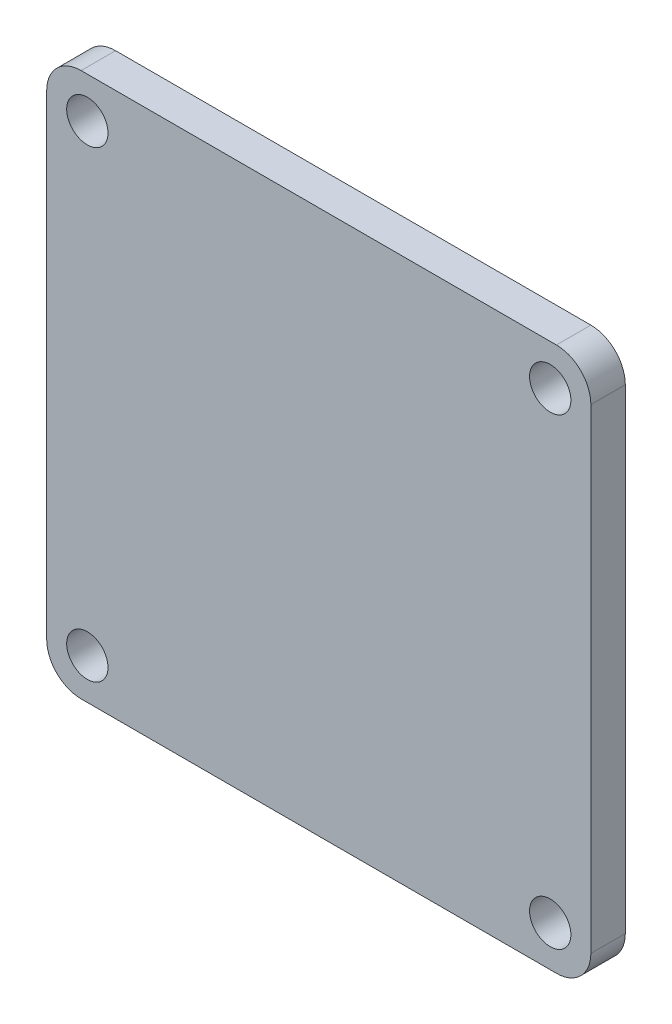
ISO-10303-21;
HEADER;
FILE_DESCRIPTION(('STEP AP214'),'2;1');
FILE_NAME('part.step','',(''),(''),'','','');
FILE_SCHEMA(('AUTOMOTIVE_DESIGN { 1 0 10303 214 1 1 1 1 }'));
ENDSEC;
DATA;
#1=APPLICATION_CONTEXT('core data for automotive mechanical design processes');
#2=APPLICATION_PROTOCOL_DEFINITION('international standard','automotive_design',2000,#1);
#3=PRODUCT_CONTEXT('',#1,'mechanical');
#4=PRODUCT('Part','Part','',(#3));
#5=PRODUCT_RELATED_PRODUCT_CATEGORY('part','',(#4));
#6=PRODUCT_DEFINITION_FORMATION('','',#4);
#7=PRODUCT_DEFINITION_CONTEXT('part definition',#1,'design');
#8=PRODUCT_DEFINITION('design','',#6,#7);
#9=PRODUCT_DEFINITION_SHAPE('','',#8);
#10=(LENGTH_UNIT() NAMED_UNIT(*) SI_UNIT(.MILLI.,.METRE.));
#11=(NAMED_UNIT(*) PLANE_ANGLE_UNIT() SI_UNIT($,.RADIAN.));
#12=(NAMED_UNIT(*) SI_UNIT($,.STERADIAN.) SOLID_ANGLE_UNIT());
#13=UNCERTAINTY_MEASURE_WITH_UNIT(LENGTH_MEASURE(1.E-05),#10,'distance_accuracy_value','');
#14=(GEOMETRIC_REPRESENTATION_CONTEXT(3) GLOBAL_UNCERTAINTY_ASSIGNED_CONTEXT((#13)) GLOBAL_UNIT_ASSIGNED_CONTEXT((#10,
#11,#12)) REPRESENTATION_CONTEXT('',''));
#15=CARTESIAN_POINT('',(0.,0.,0.));
#16=DIRECTION('',(0.,0.,1.));
#17=DIRECTION('',(1.,0.,0.));
#18=AXIS2_PLACEMENT_3D('',#15,#16,#17);
#19=CARTESIAN_POINT('',(0.,0.,2.5));
#20=DIRECTION('',(1.,0.,0.));
#21=DIRECTION('',(0.,1.,0.));
#22=AXIS2_PLACEMENT_3D('',#19,#20,#21);
#23=PLANE('',#22);
#24=DIRECTION('',(0.,-1.,0.));
#25=VECTOR('',#24,1.);
#26=CARTESIAN_POINT('',(0.,0.,0.));
#27=LINE('',#26,#25);
#28=CARTESIAN_POINT('',(0.,37.,0.));
#29=VERTEX_POINT('',#28);
#30=CARTESIAN_POINT('',(0.,2.5,0.));
#31=VERTEX_POINT('',#30);
#32=EDGE_CURVE('E125',#29,#31,#27,.T.);
#33=ORIENTED_EDGE('',*,*,#32,.T.);
#34=DIRECTION('',(0.,0.,-1.));
#35=VECTOR('',#34,1.);
#36=CARTESIAN_POINT('',(0.,2.5,2.5));
#37=LINE('',#36,#35);
#38=CARTESIAN_POINT('',(0.,2.5,2.5));
#39=VERTEX_POINT('',#38);
#40=EDGE_CURVE('E103',#31,#39,#37,.F.);
#41=ORIENTED_EDGE('',*,*,#40,.T.);
#42=DIRECTION('',(0.,-1.,0.));
#43=VECTOR('',#42,1.);
#44=CARTESIAN_POINT('',(0.,0.,2.5));
#45=LINE('',#44,#43);
#46=CARTESIAN_POINT('',(0.,37.,2.5));
#47=VERTEX_POINT('',#46);
#48=EDGE_CURVE('E135',#47,#39,#45,.T.);
#49=ORIENTED_EDGE('',*,*,#48,.F.);
#50=DIRECTION('',(0.,0.,-1.));
#51=VECTOR('',#50,1.);
#52=CARTESIAN_POINT('',(0.,37.,2.5));
#53=LINE('',#52,#51);
#54=EDGE_CURVE('E108',#47,#29,#53,.T.);
#55=ORIENTED_EDGE('',*,*,#54,.T.);
#56=EDGE_LOOP('',(#33,#41,#49,#55));
#57=FACE_BOUND('',#56,.T.);
#58=ADVANCED_FACE('F32',(#57),#23,.F.);
#59=CARTESIAN_POINT('',(0.,0.,2.5));
#60=DIRECTION('',(0.,1.,0.));
#61=DIRECTION('',(0.,0.,1.));
#62=AXIS2_PLACEMENT_3D('',#59,#60,#61);
#63=PLANE('',#62);
#64=DIRECTION('',(1.,0.,0.));
#65=VECTOR('',#64,1.);
#66=CARTESIAN_POINT('',(0.,0.,2.5));
#67=LINE('',#66,#65);
#68=CARTESIAN_POINT('',(2.5,0.,2.5));
#69=VERTEX_POINT('',#68);
#70=CARTESIAN_POINT('',(37.,0.,2.5));
#71=VERTEX_POINT('',#70);
#72=EDGE_CURVE('E118',#69,#71,#67,.T.);
#73=ORIENTED_EDGE('',*,*,#72,.F.);
#74=DIRECTION('',(0.,0.,-1.));
#75=VECTOR('',#74,1.);
#76=CARTESIAN_POINT('',(2.5,0.,2.5));
#77=LINE('',#76,#75);
#78=CARTESIAN_POINT('',(2.5,0.,0.));
#79=VERTEX_POINT('',#78);
#80=EDGE_CURVE('E102',#69,#79,#77,.T.);
#81=ORIENTED_EDGE('',*,*,#80,.T.);
#82=DIRECTION('',(1.,0.,0.));
#83=VECTOR('',#82,1.);
#84=CARTESIAN_POINT('',(0.,0.,0.));
#85=LINE('',#84,#83);
#86=CARTESIAN_POINT('',(37.,0.,0.));
#87=VERTEX_POINT('',#86);
#88=EDGE_CURVE('E115',#79,#87,#85,.T.);
#89=ORIENTED_EDGE('',*,*,#88,.T.);
#90=DIRECTION('',(0.,0.,-1.));
#91=VECTOR('',#90,1.);
#92=CARTESIAN_POINT('',(37.,0.,2.5));
#93=LINE('',#92,#91);
#94=EDGE_CURVE('E120',#87,#71,#93,.F.);
#95=ORIENTED_EDGE('',*,*,#94,.T.);
#96=EDGE_LOOP('',(#73,#81,#89,#95));
#97=FACE_BOUND('',#96,.T.);
#98=ADVANCED_FACE('F114',(#97),#63,.F.);
#99=CARTESIAN_POINT('',(39.5,0.,2.5));
#100=DIRECTION('',(-1.,0.,0.));
#101=DIRECTION('',(0.,-1.,0.));
#102=AXIS2_PLACEMENT_3D('',#99,#100,#101);
#103=PLANE('',#102);
#104=DIRECTION('',(0.,1.,0.));
#105=VECTOR('',#104,1.);
#106=CARTESIAN_POINT('',(39.5,0.,2.5));
#107=LINE('',#106,#105);
#108=CARTESIAN_POINT('',(39.5,2.5,2.5));
#109=VERTEX_POINT('',#108);
#110=CARTESIAN_POINT('',(39.5,37.,2.5));
#111=VERTEX_POINT('',#110);
#112=EDGE_CURVE('E161',#109,#111,#107,.T.);
#113=ORIENTED_EDGE('',*,*,#112,.F.);
#114=DIRECTION('',(0.,0.,-1.));
#115=VECTOR('',#114,1.);
#116=CARTESIAN_POINT('',(39.5,2.5,2.5));
#117=LINE('',#116,#115);
#118=CARTESIAN_POINT('',(39.5,2.5,0.));
#119=VERTEX_POINT('',#118);
#120=EDGE_CURVE('E154',#109,#119,#117,.T.);
#121=ORIENTED_EDGE('',*,*,#120,.T.);
#122=DIRECTION('',(0.,1.,0.));
#123=VECTOR('',#122,1.);
#124=CARTESIAN_POINT('',(39.5,0.,0.));
#125=LINE('',#124,#123);
#126=CARTESIAN_POINT('',(39.5,37.,0.));
#127=VERTEX_POINT('',#126);
#128=EDGE_CURVE('E124',#119,#127,#125,.T.);
#129=ORIENTED_EDGE('',*,*,#128,.T.);
#130=DIRECTION('',(0.,0.,-1.));
#131=VECTOR('',#130,1.);
#132=CARTESIAN_POINT('',(39.5,37.,2.5));
#133=LINE('',#132,#131);
#134=EDGE_CURVE('E152',#127,#111,#133,.F.);
#135=ORIENTED_EDGE('',*,*,#134,.T.);
#136=EDGE_LOOP('',(#113,#121,#129,#135));
#137=FACE_BOUND('',#136,.T.);
#138=ADVANCED_FACE('F159',(#137),#103,.F.);
#139=CARTESIAN_POINT('',(0.,39.5,2.5));
#140=DIRECTION('',(0.,-1.,0.));
#141=DIRECTION('',(0.,0.,-1.));
#142=AXIS2_PLACEMENT_3D('',#139,#140,#141);
#143=PLANE('',#142);
#144=DIRECTION('',(-1.,0.,0.));
#145=VECTOR('',#144,1.);
#146=CARTESIAN_POINT('',(0.,39.5,2.5));
#147=LINE('',#146,#145);
#148=CARTESIAN_POINT('',(37.,39.5,2.5));
#149=VERTEX_POINT('',#148);
#150=CARTESIAN_POINT('',(2.49999999999999,39.5,2.5));
#151=VERTEX_POINT('',#150);
#152=EDGE_CURVE('E136',#149,#151,#147,.T.);
#153=ORIENTED_EDGE('',*,*,#152,.F.);
#154=DIRECTION('',(0.,0.,-1.));
#155=VECTOR('',#154,1.);
#156=CARTESIAN_POINT('',(37.,39.5,2.5));
#157=LINE('',#156,#155);
#158=CARTESIAN_POINT('',(37.,39.5,0.));
#159=VERTEX_POINT('',#158);
#160=EDGE_CURVE('E11',#149,#159,#157,.T.);
#161=ORIENTED_EDGE('',*,*,#160,.T.);
#162=DIRECTION('',(-1.,0.,0.));
#163=VECTOR('',#162,1.);
#164=CARTESIAN_POINT('',(0.,39.5,0.));
#165=LINE('',#164,#163);
#166=CARTESIAN_POINT('',(2.49999999999999,39.5,0.));
#167=VERTEX_POINT('',#166);
#168=EDGE_CURVE('E128',#159,#167,#165,.T.);
#169=ORIENTED_EDGE('',*,*,#168,.T.);
#170=DIRECTION('',(0.,0.,-1.));
#171=VECTOR('',#170,1.);
#172=CARTESIAN_POINT('',(2.49999999999999,39.5,2.5));
#173=LINE('',#172,#171);
#174=EDGE_CURVE('E40',#167,#151,#173,.F.);
#175=ORIENTED_EDGE('',*,*,#174,.T.);
#176=EDGE_LOOP('',(#153,#161,#169,#175));
#177=FACE_BOUND('',#176,.T.);
#178=ADVANCED_FACE('F168',(#177),#143,.F.);
#179=CARTESIAN_POINT('',(0.,0.,2.5));
#180=DIRECTION('',(0.,0.,-1.));
#181=DIRECTION('',(-1.,0.,0.));
#182=AXIS2_PLACEMENT_3D('',#179,#180,#181);
#183=PLANE('',#182);
#184=CARTESIAN_POINT('',(2.94999999999999,2.95,2.5));
#185=DIRECTION('',(0.,0.,1.));
#186=DIRECTION('',(1.,0.,0.));
#187=AXIS2_PLACEMENT_3D('',#184,#185,#186);
#188=CIRCLE('',#187,1.5);
#189=CARTESIAN_POINT('',(4.44999999999999,2.95,2.5));
#190=VERTEX_POINT('',#189);
#191=EDGE_CURVE('E181',#190,#190,#188,.T.);
#192=ORIENTED_EDGE('',*,*,#191,.F.);
#193=EDGE_LOOP('',(#192));
#194=FACE_BOUND('',#193,.T.);
#195=CARTESIAN_POINT('',(36.55,2.95,2.5));
#196=DIRECTION('',(0.,0.,1.));
#197=DIRECTION('',(1.,0.,0.));
#198=AXIS2_PLACEMENT_3D('',#195,#196,#197);
#199=CIRCLE('',#198,1.5);
#200=CARTESIAN_POINT('',(38.05,2.95,2.5));
#201=VERTEX_POINT('',#200);
#202=EDGE_CURVE('E187',#201,#201,#199,.T.);
#203=ORIENTED_EDGE('',*,*,#202,.F.);
#204=EDGE_LOOP('',(#203));
#205=FACE_BOUND('',#204,.T.);
#206=CARTESIAN_POINT('',(36.55,36.55,2.5));
#207=DIRECTION('',(0.,0.,1.));
#208=DIRECTION('',(1.,0.,0.));
#209=AXIS2_PLACEMENT_3D('',#206,#207,#208);
#210=CIRCLE('',#209,1.5);
#211=CARTESIAN_POINT('',(38.05,36.55,2.5));
#212=VERTEX_POINT('',#211);
#213=EDGE_CURVE('E193',#212,#212,#210,.T.);
#214=ORIENTED_EDGE('',*,*,#213,.F.);
#215=EDGE_LOOP('',(#214));
#216=FACE_BOUND('',#215,.T.);
#217=CARTESIAN_POINT('',(2.94999999999999,36.55,2.5));
#218=DIRECTION('',(0.,0.,1.));
#219=DIRECTION('',(1.,0.,0.));
#220=AXIS2_PLACEMENT_3D('',#217,#218,#219);
#221=CIRCLE('',#220,1.5);
#222=CARTESIAN_POINT('',(4.44999999999999,36.55,2.5));
#223=VERTEX_POINT('',#222);
#224=EDGE_CURVE('E175',#223,#223,#221,.T.);
#225=ORIENTED_EDGE('',*,*,#224,.F.);
#226=EDGE_LOOP('',(#225));
#227=FACE_BOUND('',#226,.T.);
#228=ORIENTED_EDGE('',*,*,#48,.T.);
#229=CARTESIAN_POINT('',(2.5,2.5,2.5));
#230=DIRECTION('',(0.,0.,-1.));
#231=DIRECTION('',(-1.,0.,0.));
#232=AXIS2_PLACEMENT_3D('',#229,#230,#231);
#233=CIRCLE('',#232,2.5);
#234=EDGE_CURVE('E150',#39,#69,#233,.F.);
#235=ORIENTED_EDGE('',*,*,#234,.T.);
#236=ORIENTED_EDGE('',*,*,#72,.T.);
#237=CARTESIAN_POINT('',(37.,2.5,2.5));
#238=DIRECTION('',(0.,0.,-1.));
#239=DIRECTION('',(-1.,0.,0.));
#240=AXIS2_PLACEMENT_3D('',#237,#238,#239);
#241=CIRCLE('',#240,2.5);
#242=EDGE_CURVE('E148',#71,#109,#241,.F.);
#243=ORIENTED_EDGE('',*,*,#242,.T.);
#244=ORIENTED_EDGE('',*,*,#112,.T.);
#245=CARTESIAN_POINT('',(37.,37.,2.5));
#246=DIRECTION('',(0.,0.,-1.));
#247=DIRECTION('',(-1.,0.,0.));
#248=AXIS2_PLACEMENT_3D('',#245,#246,#247);
#249=CIRCLE('',#248,2.5);
#250=EDGE_CURVE('E53',#111,#149,#249,.F.);
#251=ORIENTED_EDGE('',*,*,#250,.T.);
#252=ORIENTED_EDGE('',*,*,#152,.T.);
#253=CARTESIAN_POINT('',(2.49999999999999,37.,2.5));
#254=DIRECTION('',(0.,0.,-1.));
#255=DIRECTION('',(-1.,0.,0.));
#256=AXIS2_PLACEMENT_3D('',#253,#254,#255);
#257=CIRCLE('',#256,2.5);
#258=EDGE_CURVE('E145',#151,#47,#257,.F.);
#259=ORIENTED_EDGE('',*,*,#258,.T.);
#260=EDGE_LOOP('',(#228,#235,#236,#243,#244,#251,#252,#259));
#261=FACE_BOUND('',#260,.T.);
#262=ADVANCED_FACE('F209',(#194,#205,#216,#227,#261),#183,.F.);
#263=CARTESIAN_POINT('',(0.,0.,0.));
#264=DIRECTION('',(0.,0.,-1.));
#265=DIRECTION('',(-1.,0.,0.));
#266=AXIS2_PLACEMENT_3D('',#263,#264,#265);
#267=PLANE('',#266);
#268=CARTESIAN_POINT('',(2.94999999999999,2.95,0.));
#269=DIRECTION('',(0.,0.,1.));
#270=DIRECTION('',(1.,0.,0.));
#271=AXIS2_PLACEMENT_3D('',#268,#269,#270);
#272=CIRCLE('',#271,1.5);
#273=CARTESIAN_POINT('',(4.44999999999999,2.95,0.));
#274=VERTEX_POINT('',#273);
#275=EDGE_CURVE('E184',#274,#274,#272,.T.);
#276=ORIENTED_EDGE('',*,*,#275,.T.);
#277=EDGE_LOOP('',(#276));
#278=FACE_BOUND('',#277,.T.);
#279=CARTESIAN_POINT('',(36.55,2.95,0.));
#280=DIRECTION('',(0.,0.,1.));
#281=DIRECTION('',(1.,0.,0.));
#282=AXIS2_PLACEMENT_3D('',#279,#280,#281);
#283=CIRCLE('',#282,1.5);
#284=CARTESIAN_POINT('',(38.05,2.95,0.));
#285=VERTEX_POINT('',#284);
#286=EDGE_CURVE('E190',#285,#285,#283,.T.);
#287=ORIENTED_EDGE('',*,*,#286,.T.);
#288=EDGE_LOOP('',(#287));
#289=FACE_BOUND('',#288,.T.);
#290=CARTESIAN_POINT('',(36.55,36.55,0.));
#291=DIRECTION('',(0.,0.,1.));
#292=DIRECTION('',(1.,0.,0.));
#293=AXIS2_PLACEMENT_3D('',#290,#291,#292);
#294=CIRCLE('',#293,1.5);
#295=CARTESIAN_POINT('',(38.05,36.55,0.));
#296=VERTEX_POINT('',#295);
#297=EDGE_CURVE('E178',#296,#296,#294,.T.);
#298=ORIENTED_EDGE('',*,*,#297,.T.);
#299=EDGE_LOOP('',(#298));
#300=FACE_BOUND('',#299,.T.);
#301=CARTESIAN_POINT('',(2.94999999999999,36.55,0.));
#302=DIRECTION('',(0.,0.,1.));
#303=DIRECTION('',(1.,0.,0.));
#304=AXIS2_PLACEMENT_3D('',#301,#302,#303);
#305=CIRCLE('',#304,1.5);
#306=CARTESIAN_POINT('',(4.44999999999999,36.55,0.));
#307=VERTEX_POINT('',#306);
#308=EDGE_CURVE('E130',#307,#307,#305,.T.);
#309=ORIENTED_EDGE('',*,*,#308,.T.);
#310=EDGE_LOOP('',(#309));
#311=FACE_BOUND('',#310,.T.);
#312=ORIENTED_EDGE('',*,*,#88,.F.);
#313=CARTESIAN_POINT('',(2.5,2.5,0.));
#314=DIRECTION('',(0.,0.,-1.));
#315=DIRECTION('',(-1.,0.,0.));
#316=AXIS2_PLACEMENT_3D('',#313,#314,#315);
#317=CIRCLE('',#316,2.5);
#318=EDGE_CURVE('E98',#79,#31,#317,.T.);
#319=ORIENTED_EDGE('',*,*,#318,.T.);
#320=ORIENTED_EDGE('',*,*,#32,.F.);
#321=CARTESIAN_POINT('',(2.49999999999999,37.,0.));
#322=DIRECTION('',(0.,0.,-1.));
#323=DIRECTION('',(-1.,0.,0.));
#324=AXIS2_PLACEMENT_3D('',#321,#322,#323);
#325=CIRCLE('',#324,2.5);
#326=EDGE_CURVE('E119',#29,#167,#325,.T.);
#327=ORIENTED_EDGE('',*,*,#326,.T.);
#328=ORIENTED_EDGE('',*,*,#168,.F.);
#329=CARTESIAN_POINT('',(37.,37.,0.));
#330=DIRECTION('',(0.,0.,-1.));
#331=DIRECTION('',(-1.,0.,0.));
#332=AXIS2_PLACEMENT_3D('',#329,#330,#331);
#333=CIRCLE('',#332,2.5);
#334=EDGE_CURVE('E139',#159,#127,#333,.T.);
#335=ORIENTED_EDGE('',*,*,#334,.T.);
#336=ORIENTED_EDGE('',*,*,#128,.F.);
#337=CARTESIAN_POINT('',(37.,2.5,0.));
#338=DIRECTION('',(0.,0.,-1.));
#339=DIRECTION('',(-1.,0.,0.));
#340=AXIS2_PLACEMENT_3D('',#337,#338,#339);
#341=CIRCLE('',#340,2.5);
#342=EDGE_CURVE('E109',#119,#87,#341,.T.);
#343=ORIENTED_EDGE('',*,*,#342,.T.);
#344=EDGE_LOOP('',(#312,#319,#320,#327,#328,#335,#336,#343));
#345=FACE_BOUND('',#344,.T.);
#346=ADVANCED_FACE('F122',(#278,#289,#300,#311,#345),#267,.T.);
#347=CARTESIAN_POINT('',(2.94999999999999,36.55,0.));
#348=DIRECTION('',(0.,0.,1.));
#349=DIRECTION('',(1.,0.,0.));
#350=AXIS2_PLACEMENT_3D('',#347,#348,#349);
#351=CYLINDRICAL_SURFACE('',#350,1.5);
#352=ORIENTED_EDGE('',*,*,#308,.F.);
#353=EDGE_LOOP('',(#352));
#354=FACE_BOUND('',#353,.T.);
#355=ORIENTED_EDGE('',*,*,#224,.T.);
#356=EDGE_LOOP('',(#355));
#357=FACE_BOUND('',#356,.T.);
#358=ADVANCED_FACE('F205',(#354,#357),#351,.F.);
#359=CARTESIAN_POINT('',(36.55,36.55,0.));
#360=DIRECTION('',(0.,0.,1.));
#361=DIRECTION('',(1.,0.,0.));
#362=AXIS2_PLACEMENT_3D('',#359,#360,#361);
#363=CYLINDRICAL_SURFACE('',#362,1.5);
#364=ORIENTED_EDGE('',*,*,#297,.F.);
#365=EDGE_LOOP('',(#364));
#366=FACE_BOUND('',#365,.T.);
#367=ORIENTED_EDGE('',*,*,#213,.T.);
#368=EDGE_LOOP('',(#367));
#369=FACE_BOUND('',#368,.T.);
#370=ADVANCED_FACE('F201',(#366,#369),#363,.F.);
#371=CARTESIAN_POINT('',(36.55,2.95,0.));
#372=DIRECTION('',(0.,0.,1.));
#373=DIRECTION('',(1.,0.,0.));
#374=AXIS2_PLACEMENT_3D('',#371,#372,#373);
#375=CYLINDRICAL_SURFACE('',#374,1.5);
#376=ORIENTED_EDGE('',*,*,#286,.F.);
#377=EDGE_LOOP('',(#376));
#378=FACE_BOUND('',#377,.T.);
#379=ORIENTED_EDGE('',*,*,#202,.T.);
#380=EDGE_LOOP('',(#379));
#381=FACE_BOUND('',#380,.T.);
#382=ADVANCED_FACE('F204',(#378,#381),#375,.F.);
#383=CARTESIAN_POINT('',(2.94999999999999,2.95,0.));
#384=DIRECTION('',(0.,0.,1.));
#385=DIRECTION('',(1.,0.,0.));
#386=AXIS2_PLACEMENT_3D('',#383,#384,#385);
#387=CYLINDRICAL_SURFACE('',#386,1.5);
#388=ORIENTED_EDGE('',*,*,#275,.F.);
#389=EDGE_LOOP('',(#388));
#390=FACE_BOUND('',#389,.T.);
#391=ORIENTED_EDGE('',*,*,#191,.T.);
#392=EDGE_LOOP('',(#391));
#393=FACE_BOUND('',#392,.T.);
#394=ADVANCED_FACE('F234',(#390,#393),#387,.F.);
#395=CARTESIAN_POINT('',(2.5,2.5,2.5));
#396=DIRECTION('',(0.,0.,-1.));
#397=DIRECTION('',(-1.,0.,0.));
#398=AXIS2_PLACEMENT_3D('',#395,#396,#397);
#399=CYLINDRICAL_SURFACE('',#398,2.5);
#400=ORIENTED_EDGE('',*,*,#234,.F.);
#401=ORIENTED_EDGE('',*,*,#40,.F.);
#402=ORIENTED_EDGE('',*,*,#318,.F.);
#403=ORIENTED_EDGE('',*,*,#80,.F.);
#404=EDGE_LOOP('',(#400,#401,#402,#403));
#405=FACE_BOUND('',#404,.T.);
#406=ADVANCED_FACE('F101',(#405),#399,.T.);
#407=CARTESIAN_POINT('',(37.,2.5,2.5));
#408=DIRECTION('',(0.,0.,-1.));
#409=DIRECTION('',(-1.,0.,0.));
#410=AXIS2_PLACEMENT_3D('',#407,#408,#409);
#411=CYLINDRICAL_SURFACE('',#410,2.5);
#412=ORIENTED_EDGE('',*,*,#242,.F.);
#413=ORIENTED_EDGE('',*,*,#94,.F.);
#414=ORIENTED_EDGE('',*,*,#342,.F.);
#415=ORIENTED_EDGE('',*,*,#120,.F.);
#416=EDGE_LOOP('',(#412,#413,#414,#415));
#417=FACE_BOUND('',#416,.T.);
#418=ADVANCED_FACE('F223',(#417),#411,.T.);
#419=CARTESIAN_POINT('',(37.,37.,2.5));
#420=DIRECTION('',(0.,0.,-1.));
#421=DIRECTION('',(-1.,0.,0.));
#422=AXIS2_PLACEMENT_3D('',#419,#420,#421);
#423=CYLINDRICAL_SURFACE('',#422,2.5);
#424=ORIENTED_EDGE('',*,*,#250,.F.);
#425=ORIENTED_EDGE('',*,*,#134,.F.);
#426=ORIENTED_EDGE('',*,*,#334,.F.);
#427=ORIENTED_EDGE('',*,*,#160,.F.);
#428=EDGE_LOOP('',(#424,#425,#426,#427));
#429=FACE_BOUND('',#428,.T.);
#430=ADVANCED_FACE('F167',(#429),#423,.T.);
#431=CARTESIAN_POINT('',(2.49999999999999,37.,2.5));
#432=DIRECTION('',(0.,0.,-1.));
#433=DIRECTION('',(-1.,0.,0.));
#434=AXIS2_PLACEMENT_3D('',#431,#432,#433);
#435=CYLINDRICAL_SURFACE('',#434,2.5);
#436=ORIENTED_EDGE('',*,*,#258,.F.);
#437=ORIENTED_EDGE('',*,*,#174,.F.);
#438=ORIENTED_EDGE('',*,*,#326,.F.);
#439=ORIENTED_EDGE('',*,*,#54,.F.);
#440=EDGE_LOOP('',(#436,#437,#438,#439));
#441=FACE_BOUND('',#440,.T.);
#442=ADVANCED_FACE('F34',(#441),#435,.T.);
#443=CLOSED_SHELL('',(#58,#98,#138,#178,#262,#346,#358,#370,#382,#394,#406,#418,#430,#442));
#444=MANIFOLD_SOLID_BREP('B2',#443);
#445=ADVANCED_BREP_SHAPE_REPRESENTATION('',(#18,#444),#14);
#446=SHAPE_DEFINITION_REPRESENTATION(#9,#445);
ENDSEC;
END-ISO-10303-21;
